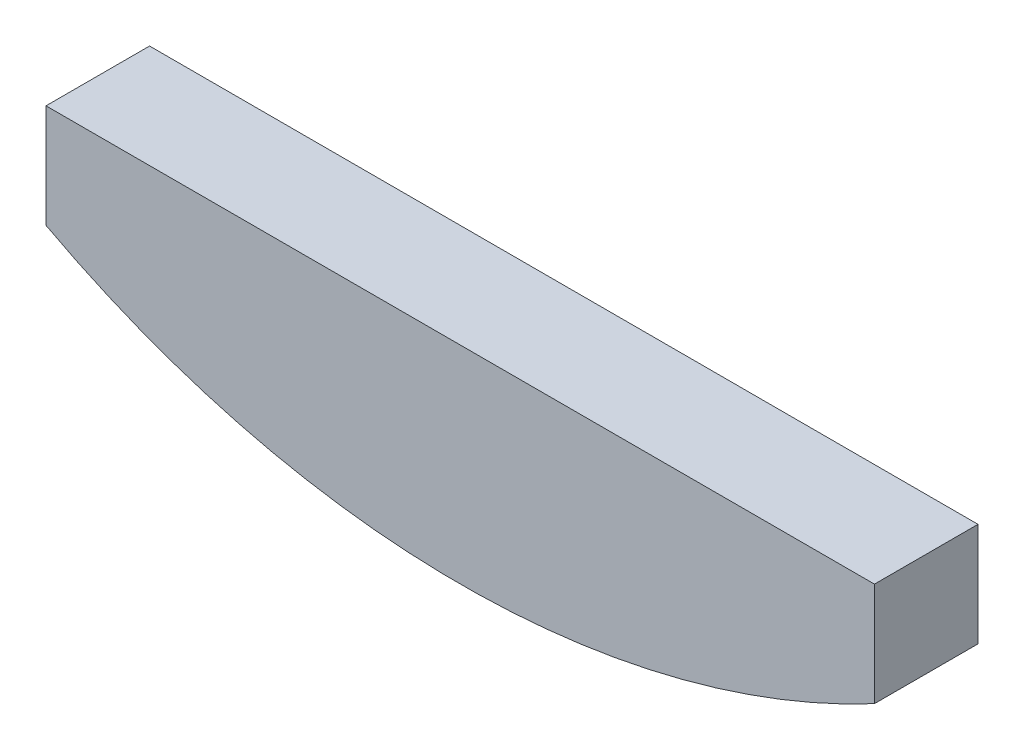
ISO-10303-21;
HEADER;
FILE_DESCRIPTION(('STEP AP214'),'2;1');
FILE_NAME('part.step','',(''),(''),'','','');
FILE_SCHEMA(('AUTOMOTIVE_DESIGN { 1 0 10303 214 1 1 1 1 }'));
ENDSEC;
DATA;
#1=APPLICATION_CONTEXT('core data for automotive mechanical design processes');
#2=APPLICATION_PROTOCOL_DEFINITION('international standard','automotive_design',2000,#1);
#3=PRODUCT_CONTEXT('',#1,'mechanical');
#4=PRODUCT('Part','Part','',(#3));
#5=PRODUCT_RELATED_PRODUCT_CATEGORY('part','',(#4));
#6=PRODUCT_DEFINITION_FORMATION('','',#4);
#7=PRODUCT_DEFINITION_CONTEXT('part definition',#1,'design');
#8=PRODUCT_DEFINITION('design','',#6,#7);
#9=PRODUCT_DEFINITION_SHAPE('','',#8);
#10=(LENGTH_UNIT() NAMED_UNIT(*) SI_UNIT(.MILLI.,.METRE.));
#11=(NAMED_UNIT(*) PLANE_ANGLE_UNIT() SI_UNIT($,.RADIAN.));
#12=(NAMED_UNIT(*) SI_UNIT($,.STERADIAN.) SOLID_ANGLE_UNIT());
#13=UNCERTAINTY_MEASURE_WITH_UNIT(LENGTH_MEASURE(1.E-05),#10,'distance_accuracy_value','');
#14=(GEOMETRIC_REPRESENTATION_CONTEXT(3) GLOBAL_UNCERTAINTY_ASSIGNED_CONTEXT((#13)) GLOBAL_UNIT_ASSIGNED_CONTEXT((#10,
#11,#12)) REPRESENTATION_CONTEXT('',''));
#15=CARTESIAN_POINT('',(0.,0.,0.));
#16=DIRECTION('',(0.,0.,1.));
#17=DIRECTION('',(1.,0.,0.));
#18=AXIS2_PLACEMENT_3D('',#15,#16,#17);
#19=CARTESIAN_POINT('',(25.4,47.625,6.35));
#20=DIRECTION('',(0.,0.,-1.));
#21=DIRECTION('',(-1.,0.,0.));
#22=AXIS2_PLACEMENT_3D('',#19,#20,#21);
#23=CYLINDRICAL_SURFACE('',#22,53.975);
#24=CARTESIAN_POINT('',(25.4,47.625,0.));
#25=DIRECTION('',(0.,0.,1.));
#26=DIRECTION('',(1.,0.,0.));
#27=AXIS2_PLACEMENT_3D('',#24,#25,#26);
#28=CIRCLE('',#27,53.975);
#29=CARTESIAN_POINT('',(0.,0.,0.));
#30=VERTEX_POINT('',#29);
#31=CARTESIAN_POINT('',(50.8,0.,0.));
#32=VERTEX_POINT('',#31);
#33=EDGE_CURVE('E97',#30,#32,#28,.T.);
#34=ORIENTED_EDGE('',*,*,#33,.T.);
#35=DIRECTION('',(0.,0.,-1.));
#36=VECTOR('',#35,1.);
#37=CARTESIAN_POINT('',(50.8,0.,6.35));
#38=LINE('',#37,#36);
#39=CARTESIAN_POINT('',(50.8,0.,6.35));
#40=VERTEX_POINT('',#39);
#41=EDGE_CURVE('E11',#40,#32,#38,.T.);
#42=ORIENTED_EDGE('',*,*,#41,.F.);
#43=CARTESIAN_POINT('',(25.4,47.625,6.35));
#44=DIRECTION('',(0.,0.,1.));
#45=DIRECTION('',(1.,0.,0.));
#46=AXIS2_PLACEMENT_3D('',#43,#44,#45);
#47=CIRCLE('',#46,53.975);
#48=CARTESIAN_POINT('',(0.,0.,6.35));
#49=VERTEX_POINT('',#48);
#50=EDGE_CURVE('E85',#49,#40,#47,.T.);
#51=ORIENTED_EDGE('',*,*,#50,.F.);
#52=DIRECTION('',(0.,0.,-1.));
#53=VECTOR('',#52,1.);
#54=CARTESIAN_POINT('',(0.,0.,6.35));
#55=LINE('',#54,#53);
#56=EDGE_CURVE('E93',#49,#30,#55,.T.);
#57=ORIENTED_EDGE('',*,*,#56,.T.);
#58=EDGE_LOOP('',(#34,#42,#51,#57));
#59=FACE_BOUND('',#58,.T.);
#60=ADVANCED_FACE('F34',(#59),#23,.T.);
#61=CARTESIAN_POINT('',(50.8,0.,6.35));
#62=DIRECTION('',(-1.,0.,0.));
#63=DIRECTION('',(0.,0.,1.));
#64=AXIS2_PLACEMENT_3D('',#61,#62,#63);
#65=PLANE('',#64);
#66=DIRECTION('',(0.,1.,0.));
#67=VECTOR('',#66,1.);
#68=CARTESIAN_POINT('',(50.8,0.,0.));
#69=LINE('',#68,#67);
#70=CARTESIAN_POINT('',(50.8,6.35,0.));
#71=VERTEX_POINT('',#70);
#72=EDGE_CURVE('E89',#32,#71,#69,.T.);
#73=ORIENTED_EDGE('',*,*,#72,.T.);
#74=DIRECTION('',(0.,0.,-1.));
#75=VECTOR('',#74,1.);
#76=CARTESIAN_POINT('',(50.8,6.35,6.35));
#77=LINE('',#76,#75);
#78=CARTESIAN_POINT('',(50.8,6.35,6.35));
#79=VERTEX_POINT('',#78);
#80=EDGE_CURVE('E42',#79,#71,#77,.T.);
#81=ORIENTED_EDGE('',*,*,#80,.F.);
#82=DIRECTION('',(0.,1.,0.));
#83=VECTOR('',#82,1.);
#84=CARTESIAN_POINT('',(50.8,0.,6.35));
#85=LINE('',#84,#83);
#86=EDGE_CURVE('E80',#40,#79,#85,.T.);
#87=ORIENTED_EDGE('',*,*,#86,.F.);
#88=ORIENTED_EDGE('',*,*,#41,.T.);
#89=EDGE_LOOP('',(#73,#81,#87,#88));
#90=FACE_BOUND('',#89,.T.);
#91=ADVANCED_FACE('F88',(#90),#65,.F.);
#92=CARTESIAN_POINT('',(0.,6.35,6.35));
#93=DIRECTION('',(0.,-1.,0.));
#94=DIRECTION('',(0.,0.,-1.));
#95=AXIS2_PLACEMENT_3D('',#92,#93,#94);
#96=PLANE('',#95);
#97=DIRECTION('',(-1.,0.,0.));
#98=VECTOR('',#97,1.);
#99=CARTESIAN_POINT('',(0.,6.35,0.));
#100=LINE('',#99,#98);
#101=CARTESIAN_POINT('',(0.,6.35,0.));
#102=VERTEX_POINT('',#101);
#103=EDGE_CURVE('E67',#71,#102,#100,.T.);
#104=ORIENTED_EDGE('',*,*,#103,.T.);
#105=DIRECTION('',(0.,0.,-1.));
#106=VECTOR('',#105,1.);
#107=CARTESIAN_POINT('',(0.,6.35,6.35));
#108=LINE('',#107,#106);
#109=CARTESIAN_POINT('',(0.,6.35,6.35));
#110=VERTEX_POINT('',#109);
#111=EDGE_CURVE('E90',#110,#102,#108,.T.);
#112=ORIENTED_EDGE('',*,*,#111,.F.);
#113=DIRECTION('',(-1.,0.,0.));
#114=VECTOR('',#113,1.);
#115=CARTESIAN_POINT('',(0.,6.35,6.35));
#116=LINE('',#115,#114);
#117=EDGE_CURVE('E83',#79,#110,#116,.T.);
#118=ORIENTED_EDGE('',*,*,#117,.F.);
#119=ORIENTED_EDGE('',*,*,#80,.T.);
#120=EDGE_LOOP('',(#104,#112,#118,#119));
#121=FACE_BOUND('',#120,.T.);
#122=ADVANCED_FACE('F91',(#121),#96,.F.);
#123=CARTESIAN_POINT('',(0.,0.,6.35));
#124=DIRECTION('',(1.,0.,0.));
#125=DIRECTION('',(0.,0.,-1.));
#126=AXIS2_PLACEMENT_3D('',#123,#124,#125);
#127=PLANE('',#126);
#128=DIRECTION('',(0.,-1.,0.));
#129=VECTOR('',#128,1.);
#130=CARTESIAN_POINT('',(0.,0.,0.));
#131=LINE('',#130,#129);
#132=EDGE_CURVE('E73',#102,#30,#131,.T.);
#133=ORIENTED_EDGE('',*,*,#132,.T.);
#134=ORIENTED_EDGE('',*,*,#56,.F.);
#135=DIRECTION('',(0.,-1.,0.));
#136=VECTOR('',#135,1.);
#137=CARTESIAN_POINT('',(0.,0.,6.35));
#138=LINE('',#137,#136);
#139=EDGE_CURVE('E50',#110,#49,#138,.T.);
#140=ORIENTED_EDGE('',*,*,#139,.F.);
#141=ORIENTED_EDGE('',*,*,#111,.T.);
#142=EDGE_LOOP('',(#133,#134,#140,#141));
#143=FACE_BOUND('',#142,.T.);
#144=ADVANCED_FACE('F104',(#143),#127,.F.);
#145=CARTESIAN_POINT('',(25.4,47.625,6.35));
#146=DIRECTION('',(0.,0.,1.));
#147=DIRECTION('',(1.,0.,0.));
#148=AXIS2_PLACEMENT_3D('',#145,#146,#147);
#149=PLANE('',#148);
#150=ORIENTED_EDGE('',*,*,#50,.T.);
#151=ORIENTED_EDGE('',*,*,#86,.T.);
#152=ORIENTED_EDGE('',*,*,#117,.T.);
#153=ORIENTED_EDGE('',*,*,#139,.T.);
#154=EDGE_LOOP('',(#150,#151,#152,#153));
#155=FACE_BOUND('',#154,.T.);
#156=ADVANCED_FACE('F81',(#155),#149,.T.);
#157=CARTESIAN_POINT('',(25.4,47.625,0.));
#158=DIRECTION('',(0.,0.,1.));
#159=DIRECTION('',(1.,0.,0.));
#160=AXIS2_PLACEMENT_3D('',#157,#158,#159);
#161=PLANE('',#160);
#162=ORIENTED_EDGE('',*,*,#33,.F.);
#163=ORIENTED_EDGE('',*,*,#132,.F.);
#164=ORIENTED_EDGE('',*,*,#103,.F.);
#165=ORIENTED_EDGE('',*,*,#72,.F.);
#166=EDGE_LOOP('',(#162,#163,#164,#165));
#167=FACE_BOUND('',#166,.T.);
#168=ADVANCED_FACE('F107',(#167),#161,.F.);
#169=CLOSED_SHELL('',(#60,#91,#122,#144,#156,#168));
#170=MANIFOLD_SOLID_BREP('B2',#169);
#171=ADVANCED_BREP_SHAPE_REPRESENTATION('',(#18,#170),#14);
#172=SHAPE_DEFINITION_REPRESENTATION(#9,#171);
ENDSEC;
END-ISO-10303-21;
